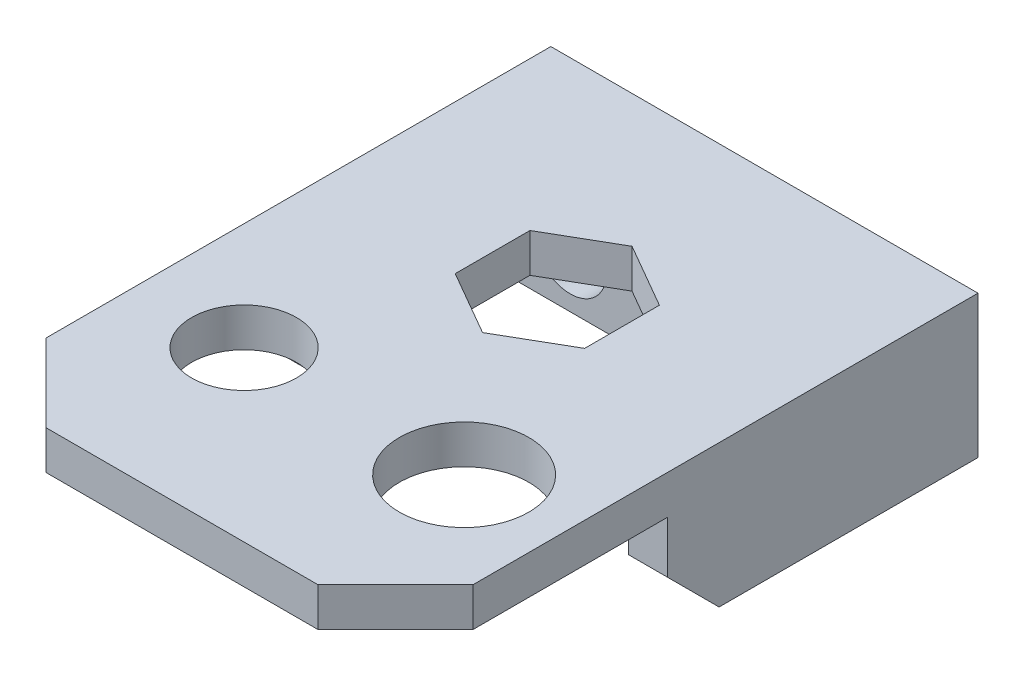
ISO-10303-21;
HEADER;
FILE_DESCRIPTION(('STEP AP214'),'2;1');
FILE_NAME('part.step','',(''),(''),'','','');
FILE_SCHEMA(('AUTOMOTIVE_DESIGN { 1 0 10303 214 1 1 1 1 }'));
ENDSEC;
DATA;
#1=APPLICATION_CONTEXT('core data for automotive mechanical design processes');
#2=APPLICATION_PROTOCOL_DEFINITION('international standard','automotive_design',2000,#1);
#3=PRODUCT_CONTEXT('',#1,'mechanical');
#4=PRODUCT('Part','Part','',(#3));
#5=PRODUCT_RELATED_PRODUCT_CATEGORY('part','',(#4));
#6=PRODUCT_DEFINITION_FORMATION('','',#4);
#7=PRODUCT_DEFINITION_CONTEXT('part definition',#1,'design');
#8=PRODUCT_DEFINITION('design','',#6,#7);
#9=PRODUCT_DEFINITION_SHAPE('','',#8);
#10=(LENGTH_UNIT() NAMED_UNIT(*) SI_UNIT(.MILLI.,.METRE.));
#11=(NAMED_UNIT(*) PLANE_ANGLE_UNIT() SI_UNIT($,.RADIAN.));
#12=(NAMED_UNIT(*) SI_UNIT($,.STERADIAN.) SOLID_ANGLE_UNIT());
#13=UNCERTAINTY_MEASURE_WITH_UNIT(LENGTH_MEASURE(1.E-05),#10,'distance_accuracy_value','');
#14=(GEOMETRIC_REPRESENTATION_CONTEXT(3) GLOBAL_UNCERTAINTY_ASSIGNED_CONTEXT((#13)) GLOBAL_UNIT_ASSIGNED_CONTEXT((#10,
#11,#12)) REPRESENTATION_CONTEXT('',''));
#15=CARTESIAN_POINT('',(0.,0.,0.));
#16=DIRECTION('',(0.,0.,1.));
#17=DIRECTION('',(1.,0.,0.));
#18=AXIS2_PLACEMENT_3D('',#15,#16,#17);
#19=CARTESIAN_POINT('',(-17.8010870987601,-4.,-32.));
#20=DIRECTION('',(0.,0.,1.));
#21=DIRECTION('',(-1.,0.,0.));
#22=AXIS2_PLACEMENT_3D('',#19,#20,#21);
#23=CYLINDRICAL_SURFACE('',#22,1.55);
#24=CARTESIAN_POINT('',(-17.8010870987601,-4.,-32.));
#25=DIRECTION('',(0.,0.,-1.));
#26=DIRECTION('',(-1.,0.,0.));
#27=AXIS2_PLACEMENT_3D('',#24,#25,#26);
#28=CIRCLE('',#27,1.55);
#29=CARTESIAN_POINT('',(-19.3510870987601,-4.,-32.));
#30=VERTEX_POINT('',#29);
#31=EDGE_CURVE('E474',#30,#30,#28,.T.);
#32=ORIENTED_EDGE('',*,*,#31,.T.);
#33=EDGE_LOOP('',(#32));
#34=FACE_BOUND('',#33,.T.);
#35=CARTESIAN_POINT('',(-17.8010870987601,-4.,-29.));
#36=DIRECTION('',(0.,0.,-1.));
#37=DIRECTION('',(-1.,0.,0.));
#38=AXIS2_PLACEMENT_3D('',#35,#36,#37);
#39=CIRCLE('',#38,1.55);
#40=CARTESIAN_POINT('',(-19.3510870987601,-4.,-29.));
#41=VERTEX_POINT('',#40);
#42=EDGE_CURVE('E492',#41,#41,#39,.T.);
#43=ORIENTED_EDGE('',*,*,#42,.F.);
#44=EDGE_LOOP('',(#43));
#45=FACE_BOUND('',#44,.T.);
#46=ADVANCED_FACE('F35',(#34,#45),#23,.F.);
#47=CARTESIAN_POINT('',(0.198912901239866,-4.,-32.));
#48=DIRECTION('',(0.,0.,1.));
#49=DIRECTION('',(-1.,0.,0.));
#50=AXIS2_PLACEMENT_3D('',#47,#48,#49);
#51=CYLINDRICAL_SURFACE('',#50,1.55);
#52=CARTESIAN_POINT('',(0.198912901239866,-4.,-32.));
#53=DIRECTION('',(0.,0.,-1.));
#54=DIRECTION('',(-1.,0.,0.));
#55=AXIS2_PLACEMENT_3D('',#52,#53,#54);
#56=CIRCLE('',#55,1.55);
#57=CARTESIAN_POINT('',(-1.35108709876013,-4.,-32.));
#58=VERTEX_POINT('',#57);
#59=EDGE_CURVE('E196',#58,#58,#56,.T.);
#60=ORIENTED_EDGE('',*,*,#59,.T.);
#61=EDGE_LOOP('',(#60));
#62=FACE_BOUND('',#61,.T.);
#63=CARTESIAN_POINT('',(0.198912901239866,-4.,-29.));
#64=DIRECTION('',(0.,0.,-1.));
#65=DIRECTION('',(-1.,0.,0.));
#66=AXIS2_PLACEMENT_3D('',#63,#64,#65);
#67=CIRCLE('',#66,1.55);
#68=CARTESIAN_POINT('',(-1.35108709876013,-4.,-29.));
#69=VERTEX_POINT('',#68);
#70=EDGE_CURVE('E483',#69,#69,#67,.T.);
#71=ORIENTED_EDGE('',*,*,#70,.F.);
#72=EDGE_LOOP('',(#71));
#73=FACE_BOUND('',#72,.T.);
#74=ADVANCED_FACE('F398',(#62,#73),#51,.F.);
#75=CARTESIAN_POINT('',(0.,0.,0.));
#76=DIRECTION('',(0.,-1.,0.));
#77=DIRECTION('',(0.,0.,-1.));
#78=AXIS2_PLACEMENT_3D('',#75,#76,#77);
#79=PLANE('',#78);
#80=DIRECTION('',(-0.866025403784439,0.,0.499999999999999));
#81=VECTOR('',#80,1.);
#82=CARTESIAN_POINT('',(-3.80108709876013,0.,-13.1132486540519));
#83=LINE('',#82,#81);
#84=CARTESIAN_POINT('',(-3.80108709876013,0.,-13.1132486540519));
#85=VERTEX_POINT('',#84);
#86=CARTESIAN_POINT('',(-8.80108709876014,0.,-10.2264973081037));
#87=VERTEX_POINT('',#86);
#88=EDGE_CURVE('E305',#85,#87,#83,.T.);
#89=ORIENTED_EDGE('',*,*,#88,.F.);
#90=DIRECTION('',(0.,0.,1.));
#91=VECTOR('',#90,1.);
#92=CARTESIAN_POINT('',(-3.80108709876013,0.,-18.8867513459481));
#93=LINE('',#92,#91);
#94=CARTESIAN_POINT('',(-3.80108709876013,0.,-18.8867513459481));
#95=VERTEX_POINT('',#94);
#96=EDGE_CURVE('E318',#95,#85,#93,.T.);
#97=ORIENTED_EDGE('',*,*,#96,.F.);
#98=DIRECTION('',(0.866025403784438,0.,0.5));
#99=VECTOR('',#98,1.);
#100=CARTESIAN_POINT('',(-8.80108709876014,0.,-21.7735026918962));
#101=LINE('',#100,#99);
#102=CARTESIAN_POINT('',(-8.80108709876014,0.,-21.7735026918962));
#103=VERTEX_POINT('',#102);
#104=EDGE_CURVE('E315',#103,#95,#101,.T.);
#105=ORIENTED_EDGE('',*,*,#104,.F.);
#106=DIRECTION('',(0.866025403784439,0.,-0.5));
#107=VECTOR('',#106,1.);
#108=CARTESIAN_POINT('',(-13.8010870987601,0.,-18.8867513459481));
#109=LINE('',#108,#107);
#110=CARTESIAN_POINT('',(-13.8010870987601,0.,-18.8867513459481));
#111=VERTEX_POINT('',#110);
#112=EDGE_CURVE('E312',#111,#103,#109,.T.);
#113=ORIENTED_EDGE('',*,*,#112,.F.);
#114=DIRECTION('',(0.,0.,-1.));
#115=VECTOR('',#114,1.);
#116=CARTESIAN_POINT('',(-13.8010870987601,0.,-13.1132486540519));
#117=LINE('',#116,#115);
#118=CARTESIAN_POINT('',(-13.8010870987601,0.,-13.1132486540519));
#119=VERTEX_POINT('',#118);
#120=EDGE_CURVE('E310',#119,#111,#117,.T.);
#121=ORIENTED_EDGE('',*,*,#120,.F.);
#122=DIRECTION('',(-0.866025403784439,0.,-0.5));
#123=VECTOR('',#122,1.);
#124=CARTESIAN_POINT('',(-8.80108709876014,0.,-10.2264973081037));
#125=LINE('',#124,#123);
#126=EDGE_CURVE('E307',#87,#119,#125,.T.);
#127=ORIENTED_EDGE('',*,*,#126,.F.);
#128=EDGE_LOOP('',(#89,#97,#105,#113,#121,#127));
#129=FACE_BOUND('',#128,.T.);
#130=CARTESIAN_POINT('',(0.,0.,0.));
#131=DIRECTION('',(0.,-1.,0.));
#132=DIRECTION('',(0.,0.,1.));
#133=AXIS2_PLACEMENT_3D('',#130,#131,#132);
#134=CIRCLE('',#133,5.);
#135=CARTESIAN_POINT('',(0.,0.,5.));
#136=VERTEX_POINT('',#135);
#137=EDGE_CURVE('E232',#136,#136,#134,.T.);
#138=ORIENTED_EDGE('',*,*,#137,.F.);
#139=EDGE_LOOP('',(#138));
#140=FACE_BOUND('',#139,.T.);
#141=CARTESIAN_POINT('',(-17.,0.,0.));
#142=DIRECTION('',(0.,-1.,0.));
#143=DIRECTION('',(0.,0.,1.));
#144=AXIS2_PLACEMENT_3D('',#141,#142,#143);
#145=CIRCLE('',#144,4.05);
#146=CARTESIAN_POINT('',(-17.,0.,4.05));
#147=VERTEX_POINT('',#146);
#148=EDGE_CURVE('E228',#147,#147,#145,.T.);
#149=ORIENTED_EDGE('',*,*,#148,.F.);
#150=EDGE_LOOP('',(#149));
#151=FACE_BOUND('',#150,.T.);
#152=DIRECTION('',(0.,0.,1.));
#153=VECTOR('',#152,1.);
#154=CARTESIAN_POINT('',(4.69891290123986,0.,-7.99999999999998));
#155=LINE('',#154,#153);
#156=CARTESIAN_POINT('',(4.69891290123986,0.,-26.));
#157=VERTEX_POINT('',#156);
#158=CARTESIAN_POINT('',(4.69891290123986,0.,-7.99999999999998));
#159=VERTEX_POINT('',#158);
#160=EDGE_CURVE('E218',#157,#159,#155,.T.);
#161=ORIENTED_EDGE('',*,*,#160,.T.);
#162=DIRECTION('',(1.,0.,0.));
#163=VECTOR('',#162,1.);
#164=CARTESIAN_POINT('',(7.69891290123986,0.,-7.99999999999998));
#165=LINE('',#164,#163);
#166=CARTESIAN_POINT('',(7.69891290123986,0.,-7.99999999999998));
#167=VERTEX_POINT('',#166);
#168=EDGE_CURVE('E214',#159,#167,#165,.T.);
#169=ORIENTED_EDGE('',*,*,#168,.T.);
#170=DIRECTION('',(0.,0.,1.));
#171=VECTOR('',#170,1.);
#172=CARTESIAN_POINT('',(7.69891290123986,0.,7.));
#173=LINE('',#172,#171);
#174=CARTESIAN_POINT('',(7.69891290123986,0.,7.));
#175=VERTEX_POINT('',#174);
#176=EDGE_CURVE('E262',#167,#175,#173,.T.);
#177=ORIENTED_EDGE('',*,*,#176,.T.);
#178=DIRECTION('',(-0.707106781186548,0.,0.707106781186548));
#179=VECTOR('',#178,1.);
#180=CARTESIAN_POINT('',(1.69891290123986,0.,13.));
#181=LINE('',#180,#179);
#182=CARTESIAN_POINT('',(1.69891290123986,0.,13.));
#183=VERTEX_POINT('',#182);
#184=EDGE_CURVE('E265',#175,#183,#181,.T.);
#185=ORIENTED_EDGE('',*,*,#184,.T.);
#186=DIRECTION('',(-1.,0.,0.));
#187=VECTOR('',#186,1.);
#188=CARTESIAN_POINT('',(-19.3010870987601,0.,13.));
#189=LINE('',#188,#187);
#190=CARTESIAN_POINT('',(-19.3010870987601,0.,13.));
#191=VERTEX_POINT('',#190);
#192=EDGE_CURVE('E268',#183,#191,#189,.T.);
#193=ORIENTED_EDGE('',*,*,#192,.T.);
#194=DIRECTION('',(-0.707106781186548,0.,-0.707106781186547));
#195=VECTOR('',#194,1.);
#196=CARTESIAN_POINT('',(-25.3010870987601,0.,6.99999999999999));
#197=LINE('',#196,#195);
#198=CARTESIAN_POINT('',(-25.3010870987601,0.,6.99999999999999));
#199=VERTEX_POINT('',#198);
#200=EDGE_CURVE('E245',#191,#199,#197,.T.);
#201=ORIENTED_EDGE('',*,*,#200,.T.);
#202=DIRECTION('',(0.,0.,-1.));
#203=VECTOR('',#202,1.);
#204=CARTESIAN_POINT('',(-25.3010870987601,0.,-32.));
#205=LINE('',#204,#203);
#206=CARTESIAN_POINT('',(-25.3010870987601,0.,-8.));
#207=VERTEX_POINT('',#206);
#208=EDGE_CURVE('E238',#199,#207,#205,.T.);
#209=ORIENTED_EDGE('',*,*,#208,.T.);
#210=DIRECTION('',(1.,0.,0.));
#211=VECTOR('',#210,1.);
#212=CARTESIAN_POINT('',(-22.3010870987601,0.,-8.));
#213=LINE('',#212,#211);
#214=CARTESIAN_POINT('',(-22.3010870987601,0.,-8.));
#215=VERTEX_POINT('',#214);
#216=EDGE_CURVE('E201',#207,#215,#213,.T.);
#217=ORIENTED_EDGE('',*,*,#216,.T.);
#218=DIRECTION('',(0.,0.,-1.));
#219=VECTOR('',#218,1.);
#220=CARTESIAN_POINT('',(-22.3010870987601,0.,-29.));
#221=LINE('',#220,#219);
#222=CARTESIAN_POINT('',(-22.3010870987601,0.,-26.));
#223=VERTEX_POINT('',#222);
#224=EDGE_CURVE('E180',#215,#223,#221,.T.);
#225=ORIENTED_EDGE('',*,*,#224,.T.);
#226=DIRECTION('',(1.,0.,0.));
#227=VECTOR('',#226,1.);
#228=CARTESIAN_POINT('',(4.69891290123986,0.,-26.));
#229=LINE('',#228,#227);
#230=EDGE_CURVE('E190',#223,#157,#229,.T.);
#231=ORIENTED_EDGE('',*,*,#230,.T.);
#232=EDGE_LOOP('',(#161,#169,#177,#185,#193,#201,#209,#217,#225,#231));
#233=FACE_BOUND('',#232,.T.);
#234=ADVANCED_FACE('F198',(#129,#140,#151,#233),#79,.T.);
#235=CARTESIAN_POINT('',(4.69891290123986,-8.,-7.99999999999998));
#236=DIRECTION('',(1.,0.,0.));
#237=DIRECTION('',(0.,0.,1.));
#238=AXIS2_PLACEMENT_3D('',#235,#236,#237);
#239=PLANE('',#238);
#240=DIRECTION('',(0.,1.,0.));
#241=VECTOR('',#240,1.);
#242=CARTESIAN_POINT('',(4.69891290123986,-41.5410196624969,-26.));
#243=LINE('',#242,#241);
#244=CARTESIAN_POINT('',(4.69891290123986,-8.,-26.));
#245=VERTEX_POINT('',#244);
#246=EDGE_CURVE('E187',#245,#157,#243,.T.);
#247=ORIENTED_EDGE('',*,*,#246,.F.);
#248=DIRECTION('',(0.,0.,1.));
#249=VECTOR('',#248,1.);
#250=CARTESIAN_POINT('',(4.69891290123986,-8.,-7.99999999999998));
#251=LINE('',#250,#249);
#252=CARTESIAN_POINT('',(4.69891290123986,-8.,-12.));
#253=VERTEX_POINT('',#252);
#254=EDGE_CURVE('E217',#245,#253,#251,.T.);
#255=ORIENTED_EDGE('',*,*,#254,.T.);
#256=DIRECTION('',(0.,-0.707106781186548,-0.707106781186548));
#257=VECTOR('',#256,1.);
#258=CARTESIAN_POINT('',(4.69891290123986,-6.,-9.99999999999998));
#259=LINE('',#258,#257);
#260=CARTESIAN_POINT('',(4.69891290123986,-4.,-7.99999999999998));
#261=VERTEX_POINT('',#260);
#262=EDGE_CURVE('E206',#261,#253,#259,.T.);
#263=ORIENTED_EDGE('',*,*,#262,.F.);
#264=DIRECTION('',(0.,1.,0.));
#265=VECTOR('',#264,1.);
#266=CARTESIAN_POINT('',(4.69891290123986,-8.,-7.99999999999998));
#267=LINE('',#266,#265);
#268=EDGE_CURVE('E221',#261,#159,#267,.T.);
#269=ORIENTED_EDGE('',*,*,#268,.T.);
#270=ORIENTED_EDGE('',*,*,#160,.F.);
#271=EDGE_LOOP('',(#247,#255,#263,#269,#270));
#272=FACE_BOUND('',#271,.T.);
#273=ADVANCED_FACE('F364',(#272),#239,.F.);
#274=CARTESIAN_POINT('',(-22.3010870987601,-8.,-29.));
#275=DIRECTION('',(-1.,0.,0.));
#276=DIRECTION('',(0.,0.,-1.));
#277=AXIS2_PLACEMENT_3D('',#274,#275,#276);
#278=PLANE('',#277);
#279=DIRECTION('',(0.,1.,0.));
#280=VECTOR('',#279,1.);
#281=CARTESIAN_POINT('',(-22.3010870987601,-41.5410196624969,-26.));
#282=LINE('',#281,#280);
#283=CARTESIAN_POINT('',(-22.3010870987601,-8.,-26.));
#284=VERTEX_POINT('',#283);
#285=EDGE_CURVE('E175',#284,#223,#282,.T.);
#286=ORIENTED_EDGE('',*,*,#285,.T.);
#287=ORIENTED_EDGE('',*,*,#224,.F.);
#288=DIRECTION('',(0.,1.,0.));
#289=VECTOR('',#288,1.);
#290=CARTESIAN_POINT('',(-22.3010870987601,-8.,-8.));
#291=LINE('',#290,#289);
#292=CARTESIAN_POINT('',(-22.3010870987601,-4.,-7.99999999999998));
#293=VERTEX_POINT('',#292);
#294=EDGE_CURVE('E210',#293,#215,#291,.T.);
#295=ORIENTED_EDGE('',*,*,#294,.F.);
#296=DIRECTION('',(0.,0.707106781186548,0.707106781186548));
#297=VECTOR('',#296,1.);
#298=CARTESIAN_POINT('',(-22.3010870987601,-16.5,-20.5));
#299=LINE('',#298,#297);
#300=CARTESIAN_POINT('',(-22.3010870987601,-8.,-12.));
#301=VERTEX_POINT('',#300);
#302=EDGE_CURVE('E351',#301,#293,#299,.T.);
#303=ORIENTED_EDGE('',*,*,#302,.F.);
#304=DIRECTION('',(0.,0.,-1.));
#305=VECTOR('',#304,1.);
#306=CARTESIAN_POINT('',(-22.3010870987601,-8.,-29.));
#307=LINE('',#306,#305);
#308=EDGE_CURVE('E184',#301,#284,#307,.T.);
#309=ORIENTED_EDGE('',*,*,#308,.T.);
#310=EDGE_LOOP('',(#286,#287,#295,#303,#309));
#311=FACE_BOUND('',#310,.T.);
#312=ADVANCED_FACE('F177',(#311),#278,.F.);
#313=CARTESIAN_POINT('',(0.,3.,0.));
#314=DIRECTION('',(0.,-1.,0.));
#315=DIRECTION('',(0.,0.,-1.));
#316=AXIS2_PLACEMENT_3D('',#313,#314,#315);
#317=PLANE('',#316);
#318=DIRECTION('',(-0.866025403784439,0.,-0.5));
#319=VECTOR('',#318,1.);
#320=CARTESIAN_POINT('',(-8.80108709876014,3.,-10.2264973081037));
#321=LINE('',#320,#319);
#322=CARTESIAN_POINT('',(-8.80108709876014,3.,-10.2264973081037));
#323=VERTEX_POINT('',#322);
#324=CARTESIAN_POINT('',(-13.8010870987601,3.,-13.1132486540519));
#325=VERTEX_POINT('',#324);
#326=EDGE_CURVE('E299',#323,#325,#321,.T.);
#327=ORIENTED_EDGE('',*,*,#326,.T.);
#328=DIRECTION('',(0.,0.,-1.));
#329=VECTOR('',#328,1.);
#330=CARTESIAN_POINT('',(-13.8010870987601,3.,-13.1132486540519));
#331=LINE('',#330,#329);
#332=CARTESIAN_POINT('',(-13.8010870987601,3.,-18.8867513459481));
#333=VERTEX_POINT('',#332);
#334=EDGE_CURVE('E323',#325,#333,#331,.T.);
#335=ORIENTED_EDGE('',*,*,#334,.T.);
#336=DIRECTION('',(0.866025403784439,0.,-0.5));
#337=VECTOR('',#336,1.);
#338=CARTESIAN_POINT('',(-13.8010870987601,3.,-18.8867513459481));
#339=LINE('',#338,#337);
#340=CARTESIAN_POINT('',(-8.80108709876014,3.,-21.7735026918962));
#341=VERTEX_POINT('',#340);
#342=EDGE_CURVE('E326',#333,#341,#339,.T.);
#343=ORIENTED_EDGE('',*,*,#342,.T.);
#344=DIRECTION('',(0.866025403784438,0.,0.5));
#345=VECTOR('',#344,1.);
#346=CARTESIAN_POINT('',(-8.80108709876014,3.,-21.7735026918962));
#347=LINE('',#346,#345);
#348=CARTESIAN_POINT('',(-3.80108709876013,3.,-18.8867513459481));
#349=VERTEX_POINT('',#348);
#350=EDGE_CURVE('E329',#341,#349,#347,.T.);
#351=ORIENTED_EDGE('',*,*,#350,.T.);
#352=DIRECTION('',(0.,0.,1.));
#353=VECTOR('',#352,1.);
#354=CARTESIAN_POINT('',(-3.80108709876013,3.,-18.8867513459481));
#355=LINE('',#354,#353);
#356=CARTESIAN_POINT('',(-3.80108709876013,3.,-13.1132486540519));
#357=VERTEX_POINT('',#356);
#358=EDGE_CURVE('E308',#349,#357,#355,.T.);
#359=ORIENTED_EDGE('',*,*,#358,.T.);
#360=DIRECTION('',(-0.866025403784439,0.,0.499999999999999));
#361=VECTOR('',#360,1.);
#362=CARTESIAN_POINT('',(-3.80108709876013,3.,-13.1132486540519));
#363=LINE('',#362,#361);
#364=EDGE_CURVE('E297',#357,#323,#363,.T.);
#365=ORIENTED_EDGE('',*,*,#364,.T.);
#366=EDGE_LOOP('',(#327,#335,#343,#351,#359,#365));
#367=FACE_BOUND('',#366,.T.);
#368=DIRECTION('',(0.,0.,-1.));
#369=VECTOR('',#368,1.);
#370=CARTESIAN_POINT('',(-25.3010870987601,3.,-32.));
#371=LINE('',#370,#369);
#372=CARTESIAN_POINT('',(-25.3010870987601,3.,6.99999999999999));
#373=VERTEX_POINT('',#372);
#374=CARTESIAN_POINT('',(-25.3010870987601,3.,-32.));
#375=VERTEX_POINT('',#374);
#376=EDGE_CURVE('E241',#373,#375,#371,.T.);
#377=ORIENTED_EDGE('',*,*,#376,.F.);
#378=DIRECTION('',(-0.707106781186548,0.,-0.707106781186547));
#379=VECTOR('',#378,1.);
#380=CARTESIAN_POINT('',(-25.3010870987601,3.,6.99999999999999));
#381=LINE('',#380,#379);
#382=CARTESIAN_POINT('',(-19.3010870987601,3.,13.));
#383=VERTEX_POINT('',#382);
#384=EDGE_CURVE('E257',#383,#373,#381,.T.);
#385=ORIENTED_EDGE('',*,*,#384,.F.);
#386=DIRECTION('',(-1.,0.,0.));
#387=VECTOR('',#386,1.);
#388=CARTESIAN_POINT('',(-19.3010870987601,3.,13.));
#389=LINE('',#388,#387);
#390=CARTESIAN_POINT('',(1.69891290123986,3.,13.));
#391=VERTEX_POINT('',#390);
#392=EDGE_CURVE('E254',#391,#383,#389,.T.);
#393=ORIENTED_EDGE('',*,*,#392,.F.);
#394=DIRECTION('',(-0.707106781186548,0.,0.707106781186548));
#395=VECTOR('',#394,1.);
#396=CARTESIAN_POINT('',(1.69891290123986,3.,13.));
#397=LINE('',#396,#395);
#398=CARTESIAN_POINT('',(7.69891290123986,3.,7.));
#399=VERTEX_POINT('',#398);
#400=EDGE_CURVE('E251',#399,#391,#397,.T.);
#401=ORIENTED_EDGE('',*,*,#400,.F.);
#402=DIRECTION('',(0.,0.,1.));
#403=VECTOR('',#402,1.);
#404=CARTESIAN_POINT('',(7.69891290123986,3.,7.));
#405=LINE('',#404,#403);
#406=CARTESIAN_POINT('',(7.69891290123986,3.,-32.));
#407=VERTEX_POINT('',#406);
#408=EDGE_CURVE('E248',#407,#399,#405,.T.);
#409=ORIENTED_EDGE('',*,*,#408,.F.);
#410=DIRECTION('',(1.,0.,0.));
#411=VECTOR('',#410,1.);
#412=CARTESIAN_POINT('',(0.,3.,-32.));
#413=LINE('',#412,#411);
#414=EDGE_CURVE('E244',#375,#407,#413,.T.);
#415=ORIENTED_EDGE('',*,*,#414,.F.);
#416=EDGE_LOOP('',(#377,#385,#393,#401,#409,#415));
#417=FACE_BOUND('',#416,.T.);
#418=CARTESIAN_POINT('',(0.,3.,0.));
#419=DIRECTION('',(0.,-1.,0.));
#420=DIRECTION('',(0.,0.,1.));
#421=AXIS2_PLACEMENT_3D('',#418,#419,#420);
#422=CIRCLE('',#421,5.);
#423=CARTESIAN_POINT('',(0.,3.,5.));
#424=VERTEX_POINT('',#423);
#425=EDGE_CURVE('E235',#424,#424,#422,.T.);
#426=ORIENTED_EDGE('',*,*,#425,.T.);
#427=EDGE_LOOP('',(#426));
#428=FACE_BOUND('',#427,.T.);
#429=CARTESIAN_POINT('',(-17.,3.,0.));
#430=DIRECTION('',(0.,-1.,0.));
#431=DIRECTION('',(0.,0.,1.));
#432=AXIS2_PLACEMENT_3D('',#429,#430,#431);
#433=CIRCLE('',#432,4.05);
#434=CARTESIAN_POINT('',(-17.,3.,4.05));
#435=VERTEX_POINT('',#434);
#436=EDGE_CURVE('E229',#435,#435,#433,.T.);
#437=ORIENTED_EDGE('',*,*,#436,.T.);
#438=EDGE_LOOP('',(#437));
#439=FACE_BOUND('',#438,.T.);
#440=ADVANCED_FACE('F372',(#367,#417,#428,#439),#317,.F.);
#441=CARTESIAN_POINT('',(-25.3010870987601,3.,-32.));
#442=DIRECTION('',(1.,0.,0.));
#443=DIRECTION('',(0.,0.,1.));
#444=AXIS2_PLACEMENT_3D('',#441,#442,#443);
#445=PLANE('',#444);
#446=DIRECTION('',(0.,0.,1.));
#447=VECTOR('',#446,1.);
#448=CARTESIAN_POINT('',(-25.3010870987601,-8.,-8.));
#449=LINE('',#448,#447);
#450=CARTESIAN_POINT('',(-25.3010870987601,-8.,-32.));
#451=VERTEX_POINT('',#450);
#452=CARTESIAN_POINT('',(-25.3010870987601,-8.,-12.));
#453=VERTEX_POINT('',#452);
#454=EDGE_CURVE('E202',#451,#453,#449,.T.);
#455=ORIENTED_EDGE('',*,*,#454,.T.);
#456=DIRECTION('',(0.,-0.707106781186548,-0.707106781186548));
#457=VECTOR('',#456,1.);
#458=CARTESIAN_POINT('',(-25.3010870987601,-8.,-12.));
#459=LINE('',#458,#457);
#460=CARTESIAN_POINT('',(-25.3010870987601,-4.,-7.99999999999998));
#461=VERTEX_POINT('',#460);
#462=EDGE_CURVE('E344',#461,#453,#459,.T.);
#463=ORIENTED_EDGE('',*,*,#462,.F.);
#464=DIRECTION('',(0.,1.,0.));
#465=VECTOR('',#464,1.);
#466=CARTESIAN_POINT('',(-25.3010870987601,-8.,-8.));
#467=LINE('',#466,#465);
#468=EDGE_CURVE('E212',#461,#207,#467,.T.);
#469=ORIENTED_EDGE('',*,*,#468,.T.);
#470=ORIENTED_EDGE('',*,*,#208,.F.);
#471=DIRECTION('',(0.,-1.,0.));
#472=VECTOR('',#471,1.);
#473=CARTESIAN_POINT('',(-25.3010870987601,3.,6.99999999999999));
#474=LINE('',#473,#472);
#475=EDGE_CURVE('E260',#373,#199,#474,.T.);
#476=ORIENTED_EDGE('',*,*,#475,.F.);
#477=ORIENTED_EDGE('',*,*,#376,.T.);
#478=DIRECTION('',(0.,-1.,0.));
#479=VECTOR('',#478,1.);
#480=CARTESIAN_POINT('',(-25.3010870987601,3.,-32.));
#481=LINE('',#480,#479);
#482=EDGE_CURVE('E11',#375,#451,#481,.T.);
#483=ORIENTED_EDGE('',*,*,#482,.T.);
#484=EDGE_LOOP('',(#455,#463,#469,#470,#476,#477,#483));
#485=FACE_BOUND('',#484,.T.);
#486=ADVANCED_FACE('F37',(#485),#445,.F.);
#487=CARTESIAN_POINT('',(7.69891290123986,3.,-32.));
#488=DIRECTION('',(0.,0.,1.));
#489=DIRECTION('',(-1.,0.,0.));
#490=AXIS2_PLACEMENT_3D('',#487,#488,#489);
#491=PLANE('',#490);
#492=ORIENTED_EDGE('',*,*,#31,.F.);
#493=EDGE_LOOP('',(#492));
#494=FACE_BOUND('',#493,.T.);
#495=ORIENTED_EDGE('',*,*,#59,.F.);
#496=EDGE_LOOP('',(#495));
#497=FACE_BOUND('',#496,.T.);
#498=ORIENTED_EDGE('',*,*,#482,.F.);
#499=ORIENTED_EDGE('',*,*,#414,.T.);
#500=DIRECTION('',(0.,-1.,0.));
#501=VECTOR('',#500,1.);
#502=CARTESIAN_POINT('',(7.69891290123986,3.,-32.));
#503=LINE('',#502,#501);
#504=CARTESIAN_POINT('',(7.69891290123986,-8.,-32.));
#505=VERTEX_POINT('',#504);
#506=EDGE_CURVE('E43',#407,#505,#503,.T.);
#507=ORIENTED_EDGE('',*,*,#506,.T.);
#508=DIRECTION('',(1.,0.,0.));
#509=VECTOR('',#508,1.);
#510=CARTESIAN_POINT('',(-25.3010870987601,-8.,-32.));
#511=LINE('',#510,#509);
#512=EDGE_CURVE('E283',#451,#505,#511,.T.);
#513=ORIENTED_EDGE('',*,*,#512,.F.);
#514=EDGE_LOOP('',(#498,#499,#507,#513));
#515=FACE_BOUND('',#514,.T.);
#516=ADVANCED_FACE('F281',(#494,#497,#515),#491,.F.);
#517=CARTESIAN_POINT('',(7.69891290123986,3.,7.));
#518=DIRECTION('',(-1.,0.,0.));
#519=DIRECTION('',(0.,0.,-1.));
#520=AXIS2_PLACEMENT_3D('',#517,#518,#519);
#521=PLANE('',#520);
#522=DIRECTION('',(0.,0.,-1.));
#523=VECTOR('',#522,1.);
#524=CARTESIAN_POINT('',(7.69891290123986,-8.,-7.99999999999998));
#525=LINE('',#524,#523);
#526=CARTESIAN_POINT('',(7.69891290123986,-8.,-12.));
#527=VERTEX_POINT('',#526);
#528=EDGE_CURVE('E215',#527,#505,#525,.T.);
#529=ORIENTED_EDGE('',*,*,#528,.T.);
#530=ORIENTED_EDGE('',*,*,#506,.F.);
#531=ORIENTED_EDGE('',*,*,#408,.T.);
#532=DIRECTION('',(0.,-1.,0.));
#533=VECTOR('',#532,1.);
#534=CARTESIAN_POINT('',(7.69891290123986,3.,7.));
#535=LINE('',#534,#533);
#536=EDGE_CURVE('E278',#399,#175,#535,.T.);
#537=ORIENTED_EDGE('',*,*,#536,.T.);
#538=ORIENTED_EDGE('',*,*,#176,.F.);
#539=DIRECTION('',(0.,1.,0.));
#540=VECTOR('',#539,1.);
#541=CARTESIAN_POINT('',(7.69891290123986,-8.,-7.99999999999998));
#542=LINE('',#541,#540);
#543=CARTESIAN_POINT('',(7.69891290123986,-4.,-7.99999999999998));
#544=VERTEX_POINT('',#543);
#545=EDGE_CURVE('E226',#544,#167,#542,.T.);
#546=ORIENTED_EDGE('',*,*,#545,.F.);
#547=DIRECTION('',(0.,-0.707106781186548,-0.707106781186548));
#548=VECTOR('',#547,1.);
#549=CARTESIAN_POINT('',(7.69891290123986,-8.,-12.));
#550=LINE('',#549,#548);
#551=EDGE_CURVE('E293',#544,#527,#550,.T.);
#552=ORIENTED_EDGE('',*,*,#551,.T.);
#553=EDGE_LOOP('',(#529,#530,#531,#537,#538,#546,#552));
#554=FACE_BOUND('',#553,.T.);
#555=ADVANCED_FACE('F287',(#554),#521,.F.);
#556=CARTESIAN_POINT('',(1.69891290123986,3.,13.));
#557=DIRECTION('',(-0.707106781186547,0.,-0.707106781186547));
#558=DIRECTION('',(0.707106781186548,0.,-0.707106781186548));
#559=AXIS2_PLACEMENT_3D('',#556,#557,#558);
#560=PLANE('',#559);
#561=ORIENTED_EDGE('',*,*,#184,.F.);
#562=ORIENTED_EDGE('',*,*,#536,.F.);
#563=ORIENTED_EDGE('',*,*,#400,.T.);
#564=DIRECTION('',(0.,-1.,0.));
#565=VECTOR('',#564,1.);
#566=CARTESIAN_POINT('',(1.69891290123986,3.,13.));
#567=LINE('',#566,#565);
#568=EDGE_CURVE('E276',#391,#183,#567,.T.);
#569=ORIENTED_EDGE('',*,*,#568,.T.);
#570=EDGE_LOOP('',(#561,#562,#563,#569));
#571=FACE_BOUND('',#570,.T.);
#572=ADVANCED_FACE('F378',(#571),#560,.F.);
#573=CARTESIAN_POINT('',(-19.3010870987601,3.,13.));
#574=DIRECTION('',(0.,0.,-1.));
#575=DIRECTION('',(1.,0.,0.));
#576=AXIS2_PLACEMENT_3D('',#573,#574,#575);
#577=PLANE('',#576);
#578=ORIENTED_EDGE('',*,*,#192,.F.);
#579=ORIENTED_EDGE('',*,*,#568,.F.);
#580=ORIENTED_EDGE('',*,*,#392,.T.);
#581=DIRECTION('',(0.,-1.,0.));
#582=VECTOR('',#581,1.);
#583=CARTESIAN_POINT('',(-19.3010870987601,3.,13.));
#584=LINE('',#583,#582);
#585=EDGE_CURVE('E274',#383,#191,#584,.T.);
#586=ORIENTED_EDGE('',*,*,#585,.T.);
#587=EDGE_LOOP('',(#578,#579,#580,#586));
#588=FACE_BOUND('',#587,.T.);
#589=ADVANCED_FACE('F459',(#588),#577,.F.);
#590=CARTESIAN_POINT('',(-25.3010870987601,3.,6.99999999999999));
#591=DIRECTION('',(0.707106781186547,0.,-0.707106781186548));
#592=DIRECTION('',(0.707106781186548,0.,0.707106781186547));
#593=AXIS2_PLACEMENT_3D('',#590,#591,#592);
#594=PLANE('',#593);
#595=ORIENTED_EDGE('',*,*,#200,.F.);
#596=ORIENTED_EDGE('',*,*,#585,.F.);
#597=ORIENTED_EDGE('',*,*,#384,.T.);
#598=ORIENTED_EDGE('',*,*,#475,.T.);
#599=EDGE_LOOP('',(#595,#596,#597,#598));
#600=FACE_BOUND('',#599,.T.);
#601=ADVANCED_FACE('F456',(#600),#594,.F.);
#602=CARTESIAN_POINT('',(0.,3.,0.));
#603=DIRECTION('',(0.,-1.,0.));
#604=DIRECTION('',(0.,0.,-1.));
#605=AXIS2_PLACEMENT_3D('',#602,#603,#604);
#606=CYLINDRICAL_SURFACE('',#605,5.);
#607=ORIENTED_EDGE('',*,*,#425,.F.);
#608=EDGE_LOOP('',(#607));
#609=FACE_BOUND('',#608,.T.);
#610=ORIENTED_EDGE('',*,*,#137,.T.);
#611=EDGE_LOOP('',(#610));
#612=FACE_BOUND('',#611,.T.);
#613=ADVANCED_FACE('F393',(#609,#612),#606,.F.);
#614=CARTESIAN_POINT('',(-17.,3.,0.));
#615=DIRECTION('',(0.,-1.,0.));
#616=DIRECTION('',(0.,0.,-1.));
#617=AXIS2_PLACEMENT_3D('',#614,#615,#616);
#618=CYLINDRICAL_SURFACE('',#617,4.05);
#619=ORIENTED_EDGE('',*,*,#436,.F.);
#620=EDGE_LOOP('',(#619));
#621=FACE_BOUND('',#620,.T.);
#622=ORIENTED_EDGE('',*,*,#148,.T.);
#623=EDGE_LOOP('',(#622));
#624=FACE_BOUND('',#623,.T.);
#625=ADVANCED_FACE('F385',(#621,#624),#618,.F.);
#626=CARTESIAN_POINT('',(7.69891290123986,-8.,-7.99999999999998));
#627=DIRECTION('',(0.,0.,-1.));
#628=DIRECTION('',(1.,0.,0.));
#629=AXIS2_PLACEMENT_3D('',#626,#627,#628);
#630=PLANE('',#629);
#631=ORIENTED_EDGE('',*,*,#545,.T.);
#632=ORIENTED_EDGE('',*,*,#168,.F.);
#633=ORIENTED_EDGE('',*,*,#268,.F.);
#634=DIRECTION('',(1.,0.,0.));
#635=VECTOR('',#634,1.);
#636=CARTESIAN_POINT('',(-25.3010870987601,-4.,-7.99999999999998));
#637=LINE('',#636,#635);
#638=EDGE_CURVE('E347',#261,#544,#637,.T.);
#639=ORIENTED_EDGE('',*,*,#638,.T.);
#640=EDGE_LOOP('',(#631,#632,#633,#639));
#641=FACE_BOUND('',#640,.T.);
#642=ADVANCED_FACE('F383',(#641),#630,.F.);
#643=CARTESIAN_POINT('',(0.,-8.,0.));
#644=DIRECTION('',(0.,1.,0.));
#645=DIRECTION('',(0.,0.,1.));
#646=AXIS2_PLACEMENT_3D('',#643,#644,#645);
#647=PLANE('',#646);
#648=DIRECTION('',(-1.,0.,0.));
#649=VECTOR('',#648,1.);
#650=CARTESIAN_POINT('',(4.69891290123986,-8.,-26.));
#651=LINE('',#650,#649);
#652=EDGE_CURVE('E186',#245,#284,#651,.T.);
#653=ORIENTED_EDGE('',*,*,#652,.T.);
#654=ORIENTED_EDGE('',*,*,#308,.F.);
#655=DIRECTION('',(1.,0.,0.));
#656=VECTOR('',#655,1.);
#657=CARTESIAN_POINT('',(-25.3010870987601,-8.,-12.));
#658=LINE('',#657,#656);
#659=EDGE_CURVE('E349',#453,#301,#658,.T.);
#660=ORIENTED_EDGE('',*,*,#659,.F.);
#661=ORIENTED_EDGE('',*,*,#454,.F.);
#662=ORIENTED_EDGE('',*,*,#512,.T.);
#663=ORIENTED_EDGE('',*,*,#528,.F.);
#664=EDGE_CURVE('E352',#253,#527,#658,.T.);
#665=ORIENTED_EDGE('',*,*,#664,.F.);
#666=ORIENTED_EDGE('',*,*,#254,.F.);
#667=EDGE_LOOP('',(#653,#654,#660,#661,#662,#663,#665,#666));
#668=FACE_BOUND('',#667,.T.);
#669=ADVANCED_FACE('F296',(#668),#647,.F.);
#670=CARTESIAN_POINT('',(-22.3010870987601,-8.,-8.));
#671=DIRECTION('',(0.,0.,-1.));
#672=DIRECTION('',(1.,0.,0.));
#673=AXIS2_PLACEMENT_3D('',#670,#671,#672);
#674=PLANE('',#673);
#675=ORIENTED_EDGE('',*,*,#294,.T.);
#676=ORIENTED_EDGE('',*,*,#216,.F.);
#677=ORIENTED_EDGE('',*,*,#468,.F.);
#678=EDGE_CURVE('E353',#461,#293,#637,.T.);
#679=ORIENTED_EDGE('',*,*,#678,.T.);
#680=EDGE_LOOP('',(#675,#676,#677,#679));
#681=FACE_BOUND('',#680,.T.);
#682=ADVANCED_FACE('F391',(#681),#674,.F.);
#683=CARTESIAN_POINT('',(-25.3010870987601,-8.,-12.));
#684=DIRECTION('',(0.,0.707106781186547,-0.707106781186547));
#685=DIRECTION('',(0.,0.707106781186548,0.707106781186548));
#686=AXIS2_PLACEMENT_3D('',#683,#684,#685);
#687=PLANE('',#686);
#688=ORIENTED_EDGE('',*,*,#659,.T.);
#689=ORIENTED_EDGE('',*,*,#302,.T.);
#690=ORIENTED_EDGE('',*,*,#678,.F.);
#691=ORIENTED_EDGE('',*,*,#462,.T.);
#692=EDGE_LOOP('',(#688,#689,#690,#691));
#693=FACE_BOUND('',#692,.T.);
#694=ADVANCED_FACE('F366',(#693),#687,.F.);
#695=ORIENTED_EDGE('',*,*,#638,.F.);
#696=ORIENTED_EDGE('',*,*,#262,.T.);
#697=ORIENTED_EDGE('',*,*,#664,.T.);
#698=ORIENTED_EDGE('',*,*,#551,.F.);
#699=EDGE_LOOP('',(#695,#696,#697,#698));
#700=FACE_BOUND('',#699,.T.);
#701=ADVANCED_FACE('F360',(#700),#687,.F.);
#702=CARTESIAN_POINT('',(-3.80108709876013,0.,-13.1132486540519));
#703=DIRECTION('',(0.499999999999999,0.,0.866025403784439));
#704=DIRECTION('',(-0.866025403784439,0.,0.499999999999999));
#705=AXIS2_PLACEMENT_3D('',#702,#703,#704);
#706=PLANE('',#705);
#707=ORIENTED_EDGE('',*,*,#364,.F.);
#708=DIRECTION('',(0.,1.,0.));
#709=VECTOR('',#708,1.);
#710=CARTESIAN_POINT('',(-3.80108709876013,0.,-13.1132486540519));
#711=LINE('',#710,#709);
#712=EDGE_CURVE('E334',#85,#357,#711,.T.);
#713=ORIENTED_EDGE('',*,*,#712,.F.);
#714=ORIENTED_EDGE('',*,*,#88,.T.);
#715=DIRECTION('',(0.,1.,0.));
#716=VECTOR('',#715,1.);
#717=CARTESIAN_POINT('',(-8.80108709876014,0.,-10.2264973081037));
#718=LINE('',#717,#716);
#719=EDGE_CURVE('E58',#87,#323,#718,.T.);
#720=ORIENTED_EDGE('',*,*,#719,.T.);
#721=EDGE_LOOP('',(#707,#713,#714,#720));
#722=FACE_BOUND('',#721,.T.);
#723=ADVANCED_FACE('F420',(#722),#706,.F.);
#724=CARTESIAN_POINT('',(-3.80108709876013,0.,-18.8867513459481));
#725=DIRECTION('',(1.,0.,0.));
#726=DIRECTION('',(0.,0.,1.));
#727=AXIS2_PLACEMENT_3D('',#724,#725,#726);
#728=PLANE('',#727);
#729=ORIENTED_EDGE('',*,*,#358,.F.);
#730=DIRECTION('',(0.,1.,0.));
#731=VECTOR('',#730,1.);
#732=CARTESIAN_POINT('',(-3.80108709876013,0.,-18.8867513459481));
#733=LINE('',#732,#731);
#734=EDGE_CURVE('E336',#95,#349,#733,.T.);
#735=ORIENTED_EDGE('',*,*,#734,.F.);
#736=ORIENTED_EDGE('',*,*,#96,.T.);
#737=ORIENTED_EDGE('',*,*,#712,.T.);
#738=EDGE_LOOP('',(#729,#735,#736,#737));
#739=FACE_BOUND('',#738,.T.);
#740=ADVANCED_FACE('F416',(#739),#728,.F.);
#741=CARTESIAN_POINT('',(-8.80108709876014,0.,-21.7735026918962));
#742=DIRECTION('',(0.5,0.,-0.866025403784439));
#743=DIRECTION('',(0.866025403784439,0.,0.5));
#744=AXIS2_PLACEMENT_3D('',#741,#742,#743);
#745=PLANE('',#744);
#746=ORIENTED_EDGE('',*,*,#350,.F.);
#747=DIRECTION('',(0.,1.,0.));
#748=VECTOR('',#747,1.);
#749=CARTESIAN_POINT('',(-8.80108709876014,0.,-21.7735026918962));
#750=LINE('',#749,#748);
#751=EDGE_CURVE('E338',#103,#341,#750,.T.);
#752=ORIENTED_EDGE('',*,*,#751,.F.);
#753=ORIENTED_EDGE('',*,*,#104,.T.);
#754=ORIENTED_EDGE('',*,*,#734,.T.);
#755=EDGE_LOOP('',(#746,#752,#753,#754));
#756=FACE_BOUND('',#755,.T.);
#757=ADVANCED_FACE('F419',(#756),#745,.F.);
#758=CARTESIAN_POINT('',(-13.8010870987601,0.,-18.8867513459481));
#759=DIRECTION('',(-0.5,0.,-0.866025403784439));
#760=DIRECTION('',(0.866025403784439,0.,-0.5));
#761=AXIS2_PLACEMENT_3D('',#758,#759,#760);
#762=PLANE('',#761);
#763=ORIENTED_EDGE('',*,*,#342,.F.);
#764=DIRECTION('',(0.,1.,0.));
#765=VECTOR('',#764,1.);
#766=CARTESIAN_POINT('',(-13.8010870987601,0.,-18.8867513459481));
#767=LINE('',#766,#765);
#768=EDGE_CURVE('E340',#111,#333,#767,.T.);
#769=ORIENTED_EDGE('',*,*,#768,.F.);
#770=ORIENTED_EDGE('',*,*,#112,.T.);
#771=ORIENTED_EDGE('',*,*,#751,.T.);
#772=EDGE_LOOP('',(#763,#769,#770,#771));
#773=FACE_BOUND('',#772,.T.);
#774=ADVANCED_FACE('F424',(#773),#762,.F.);
#775=CARTESIAN_POINT('',(-13.8010870987601,0.,-13.1132486540519));
#776=DIRECTION('',(-1.,0.,0.));
#777=DIRECTION('',(0.,0.,-1.));
#778=AXIS2_PLACEMENT_3D('',#775,#776,#777);
#779=PLANE('',#778);
#780=ORIENTED_EDGE('',*,*,#334,.F.);
#781=DIRECTION('',(0.,1.,0.));
#782=VECTOR('',#781,1.);
#783=CARTESIAN_POINT('',(-13.8010870987601,0.,-13.1132486540519));
#784=LINE('',#783,#782);
#785=EDGE_CURVE('E50',#119,#325,#784,.T.);
#786=ORIENTED_EDGE('',*,*,#785,.F.);
#787=ORIENTED_EDGE('',*,*,#120,.T.);
#788=ORIENTED_EDGE('',*,*,#768,.T.);
#789=EDGE_LOOP('',(#780,#786,#787,#788));
#790=FACE_BOUND('',#789,.T.);
#791=ADVANCED_FACE('F428',(#790),#779,.F.);
#792=CARTESIAN_POINT('',(-8.80108709876014,0.,-10.2264973081037));
#793=DIRECTION('',(-0.5,0.,0.866025403784438));
#794=DIRECTION('',(-0.866025403784439,0.,-0.5));
#795=AXIS2_PLACEMENT_3D('',#792,#793,#794);
#796=PLANE('',#795);
#797=ORIENTED_EDGE('',*,*,#326,.F.);
#798=ORIENTED_EDGE('',*,*,#719,.F.);
#799=ORIENTED_EDGE('',*,*,#126,.T.);
#800=ORIENTED_EDGE('',*,*,#785,.T.);
#801=EDGE_LOOP('',(#797,#798,#799,#800));
#802=FACE_BOUND('',#801,.T.);
#803=ADVANCED_FACE('F414',(#802),#796,.F.);
#804=CARTESIAN_POINT('',(4.69891290123986,-41.5410196624969,-26.));
#805=DIRECTION('',(0.,0.,-1.));
#806=DIRECTION('',(1.,0.,0.));
#807=AXIS2_PLACEMENT_3D('',#804,#805,#806);
#808=PLANE('',#807);
#809=CARTESIAN_POINT('',(-17.8010870987601,-4.,-26.));
#810=DIRECTION('',(0.,0.,-1.));
#811=DIRECTION('',(-1.,0.,0.));
#812=AXIS2_PLACEMENT_3D('',#809,#810,#811);
#813=CIRCLE('',#812,2.8);
#814=CARTESIAN_POINT('',(-20.6010870987601,-4.,-26.));
#815=VERTEX_POINT('',#814);
#816=EDGE_CURVE('E489',#815,#815,#813,.T.);
#817=ORIENTED_EDGE('',*,*,#816,.T.);
#818=EDGE_LOOP('',(#817));
#819=FACE_BOUND('',#818,.T.);
#820=CARTESIAN_POINT('',(0.198912901239866,-4.,-26.));
#821=DIRECTION('',(0.,0.,-1.));
#822=DIRECTION('',(-1.,0.,0.));
#823=AXIS2_PLACEMENT_3D('',#820,#821,#822);
#824=CIRCLE('',#823,2.8);
#825=CARTESIAN_POINT('',(-2.60108709876013,-4.,-26.));
#826=VERTEX_POINT('',#825);
#827=EDGE_CURVE('E480',#826,#826,#824,.T.);
#828=ORIENTED_EDGE('',*,*,#827,.T.);
#829=EDGE_LOOP('',(#828));
#830=FACE_BOUND('',#829,.T.);
#831=ORIENTED_EDGE('',*,*,#246,.T.);
#832=ORIENTED_EDGE('',*,*,#230,.F.);
#833=ORIENTED_EDGE('',*,*,#285,.F.);
#834=ORIENTED_EDGE('',*,*,#652,.F.);
#835=EDGE_LOOP('',(#831,#832,#833,#834));
#836=FACE_BOUND('',#835,.T.);
#837=ADVANCED_FACE('F191',(#819,#830,#836),#808,.F.);
#838=CARTESIAN_POINT('',(0.198912901239866,-4.,-29.));
#839=DIRECTION('',(0.,0.,1.));
#840=DIRECTION('',(-1.,0.,0.));
#841=AXIS2_PLACEMENT_3D('',#838,#839,#840);
#842=CYLINDRICAL_SURFACE('',#841,2.8);
#843=CARTESIAN_POINT('',(0.198912901239866,-4.,-29.));
#844=DIRECTION('',(0.,0.,-1.));
#845=DIRECTION('',(-1.,0.,0.));
#846=AXIS2_PLACEMENT_3D('',#843,#844,#845);
#847=CIRCLE('',#846,2.8);
#848=CARTESIAN_POINT('',(-2.60108709876013,-4.,-29.));
#849=VERTEX_POINT('',#848);
#850=EDGE_CURVE('E477',#849,#849,#847,.T.);
#851=ORIENTED_EDGE('',*,*,#850,.T.);
#852=EDGE_LOOP('',(#851));
#853=FACE_BOUND('',#852,.T.);
#854=ORIENTED_EDGE('',*,*,#827,.F.);
#855=EDGE_LOOP('',(#854));
#856=FACE_BOUND('',#855,.T.);
#857=ADVANCED_FACE('F409',(#853,#856),#842,.F.);
#858=CARTESIAN_POINT('',(0.198912901239866,-4.,-29.));
#859=DIRECTION('',(0.,0.,1.));
#860=DIRECTION('',(-1.,0.,0.));
#861=AXIS2_PLACEMENT_3D('',#858,#859,#860);
#862=PLANE('',#861);
#863=ORIENTED_EDGE('',*,*,#70,.T.);
#864=EDGE_LOOP('',(#863));
#865=FACE_BOUND('',#864,.T.);
#866=ORIENTED_EDGE('',*,*,#850,.F.);
#867=EDGE_LOOP('',(#866));
#868=FACE_BOUND('',#867,.T.);
#869=ADVANCED_FACE('F507',(#865,#868),#862,.T.);
#870=CARTESIAN_POINT('',(-17.8010870987601,-4.,-29.));
#871=DIRECTION('',(0.,0.,1.));
#872=DIRECTION('',(-1.,0.,0.));
#873=AXIS2_PLACEMENT_3D('',#870,#871,#872);
#874=CYLINDRICAL_SURFACE('',#873,2.8);
#875=CARTESIAN_POINT('',(-17.8010870987601,-4.,-29.));
#876=DIRECTION('',(0.,0.,-1.));
#877=DIRECTION('',(-1.,0.,0.));
#878=AXIS2_PLACEMENT_3D('',#875,#876,#877);
#879=CIRCLE('',#878,2.8);
#880=CARTESIAN_POINT('',(-20.6010870987601,-4.,-29.));
#881=VERTEX_POINT('',#880);
#882=EDGE_CURVE('E488',#881,#881,#879,.T.);
#883=ORIENTED_EDGE('',*,*,#882,.T.);
#884=EDGE_LOOP('',(#883));
#885=FACE_BOUND('',#884,.T.);
#886=ORIENTED_EDGE('',*,*,#816,.F.);
#887=EDGE_LOOP('',(#886));
#888=FACE_BOUND('',#887,.T.);
#889=ADVANCED_FACE('F501',(#885,#888),#874,.F.);
#890=CARTESIAN_POINT('',(-17.8010870987601,-4.,-29.));
#891=DIRECTION('',(0.,0.,1.));
#892=DIRECTION('',(-1.,0.,0.));
#893=AXIS2_PLACEMENT_3D('',#890,#891,#892);
#894=PLANE('',#893);
#895=ORIENTED_EDGE('',*,*,#42,.T.);
#896=EDGE_LOOP('',(#895));
#897=FACE_BOUND('',#896,.T.);
#898=ORIENTED_EDGE('',*,*,#882,.F.);
#899=EDGE_LOOP('',(#898));
#900=FACE_BOUND('',#899,.T.);
#901=ADVANCED_FACE('F498',(#897,#900),#894,.T.);
#902=CLOSED_SHELL('',(#46,#74,#234,#273,#312,#440,#486,#516,#555,#572,#589,#601,#613,#625,#642,
#669,#682,#694,#701,#723,#740,#757,#774,#791,#803,#837,#857,#869,#889,#901));
#903=MANIFOLD_SOLID_BREP('B2',#902);
#904=ADVANCED_BREP_SHAPE_REPRESENTATION('',(#18,#903),#14);
#905=SHAPE_DEFINITION_REPRESENTATION(#9,#904);
ENDSEC;
END-ISO-10303-21;
